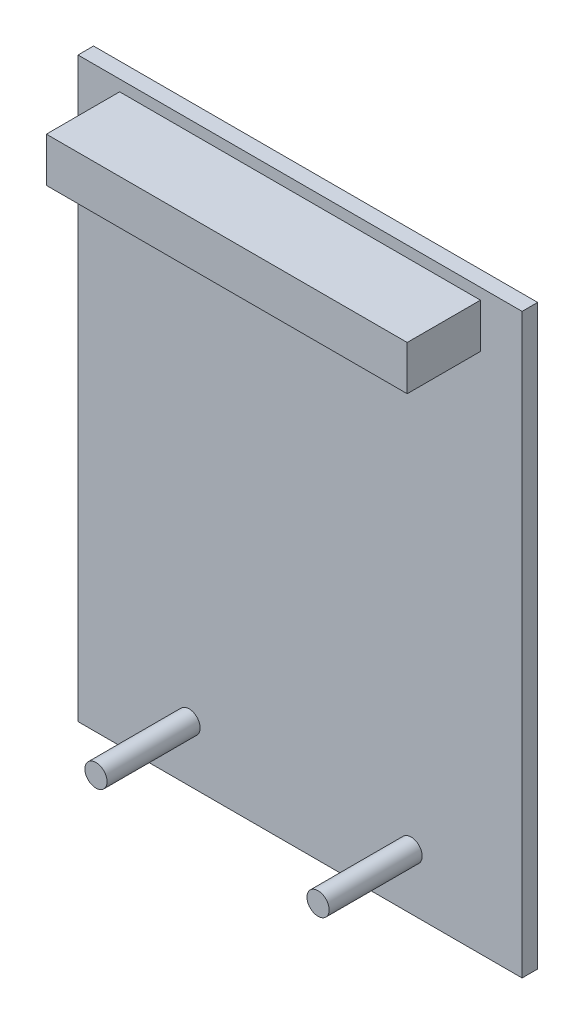
ISO-10303-21;
HEADER;
FILE_DESCRIPTION(('STEP AP214'),'2;1');
FILE_NAME('part.step','',(''),(''),'','','');
FILE_SCHEMA(('AUTOMOTIVE_DESIGN { 1 0 10303 214 1 1 1 1 }'));
ENDSEC;
DATA;
#1=APPLICATION_CONTEXT('core data for automotive mechanical design processes');
#2=APPLICATION_PROTOCOL_DEFINITION('international standard','automotive_design',2000,#1);
#3=PRODUCT_CONTEXT('',#1,'mechanical');
#4=PRODUCT('Part','Part','',(#3));
#5=PRODUCT_RELATED_PRODUCT_CATEGORY('part','',(#4));
#6=PRODUCT_DEFINITION_FORMATION('','',#4);
#7=PRODUCT_DEFINITION_CONTEXT('part definition',#1,'design');
#8=PRODUCT_DEFINITION('design','',#6,#7);
#9=PRODUCT_DEFINITION_SHAPE('','',#8);
#10=(LENGTH_UNIT() NAMED_UNIT(*) SI_UNIT(.MILLI.,.METRE.));
#11=(NAMED_UNIT(*) PLANE_ANGLE_UNIT() SI_UNIT($,.RADIAN.));
#12=(NAMED_UNIT(*) SI_UNIT($,.STERADIAN.) SOLID_ANGLE_UNIT());
#13=UNCERTAINTY_MEASURE_WITH_UNIT(LENGTH_MEASURE(1.E-05),#10,'distance_accuracy_value','');
#14=(GEOMETRIC_REPRESENTATION_CONTEXT(3) GLOBAL_UNCERTAINTY_ASSIGNED_CONTEXT((#13)) GLOBAL_UNIT_ASSIGNED_CONTEXT((#10,
#11,#12)) REPRESENTATION_CONTEXT('',''));
#15=CARTESIAN_POINT('',(0.,0.,0.));
#16=DIRECTION('',(0.,0.,1.));
#17=DIRECTION('',(1.,0.,0.));
#18=AXIS2_PLACEMENT_3D('',#15,#16,#17);
#19=CARTESIAN_POINT('',(0.,0.,1.778));
#20=DIRECTION('',(0.,0.,1.));
#21=DIRECTION('',(1.,0.,0.));
#22=AXIS2_PLACEMENT_3D('',#19,#20,#21);
#23=PLANE('',#22);
#24=CARTESIAN_POINT('',(38.1,6.35000000000001,1.778));
#25=DIRECTION('',(0.,0.,1.));
#26=DIRECTION('',(1.,0.,0.));
#27=AXIS2_PLACEMENT_3D('',#24,#25,#26);
#28=CIRCLE('',#27,1.27);
#29=CARTESIAN_POINT('',(39.37,6.35000000000001,1.778));
#30=VERTEX_POINT('',#29);
#31=EDGE_CURVE('E220',#30,#30,#28,.T.);
#32=ORIENTED_EDGE('',*,*,#31,.F.);
#33=EDGE_LOOP('',(#32));
#34=FACE_BOUND('',#33,.T.);
#35=CARTESIAN_POINT('',(12.7,6.35000000000001,1.778));
#36=DIRECTION('',(0.,0.,1.));
#37=DIRECTION('',(1.,0.,0.));
#38=AXIS2_PLACEMENT_3D('',#35,#36,#37);
#39=CIRCLE('',#38,1.27);
#40=CARTESIAN_POINT('',(13.97,6.35000000000001,1.778));
#41=VERTEX_POINT('',#40);
#42=EDGE_CURVE('E219',#41,#41,#39,.T.);
#43=ORIENTED_EDGE('',*,*,#42,.F.);
#44=EDGE_LOOP('',(#43));
#45=FACE_BOUND('',#44,.T.);
#46=DIRECTION('',(0.,-1.,0.));
#47=VECTOR('',#46,1.);
#48=CARTESIAN_POINT('',(0.,66.04,1.778));
#49=LINE('',#48,#47);
#50=CARTESIAN_POINT('',(0.,66.04,1.778));
#51=VERTEX_POINT('',#50);
#52=CARTESIAN_POINT('',(0.,0.,1.778));
#53=VERTEX_POINT('',#52);
#54=EDGE_CURVE('E140',#51,#53,#49,.T.);
#55=ORIENTED_EDGE('',*,*,#54,.T.);
#56=DIRECTION('',(1.,0.,0.));
#57=VECTOR('',#56,1.);
#58=CARTESIAN_POINT('',(0.,0.,1.778));
#59=LINE('',#58,#57);
#60=CARTESIAN_POINT('',(50.8,0.,1.778));
#61=VERTEX_POINT('',#60);
#62=EDGE_CURVE('E85',#53,#61,#59,.T.);
#63=ORIENTED_EDGE('',*,*,#62,.T.);
#64=DIRECTION('',(0.,1.,0.));
#65=VECTOR('',#64,1.);
#66=CARTESIAN_POINT('',(50.8,66.04,1.778));
#67=LINE('',#66,#65);
#68=CARTESIAN_POINT('',(50.8,66.04,1.778));
#69=VERTEX_POINT('',#68);
#70=EDGE_CURVE('E143',#61,#69,#67,.T.);
#71=ORIENTED_EDGE('',*,*,#70,.T.);
#72=DIRECTION('',(-1.,0.,0.));
#73=VECTOR('',#72,1.);
#74=CARTESIAN_POINT('',(0.,66.04,1.778));
#75=LINE('',#74,#73);
#76=EDGE_CURVE('E57',#69,#51,#75,.T.);
#77=ORIENTED_EDGE('',*,*,#76,.T.);
#78=EDGE_LOOP('',(#55,#63,#71,#77));
#79=FACE_BOUND('',#78,.T.);
#80=DIRECTION('',(1.,0.,0.));
#81=VECTOR('',#80,1.);
#82=CARTESIAN_POINT('',(4.76250000000001,59.69,1.778));
#83=LINE('',#82,#81);
#84=CARTESIAN_POINT('',(4.76250000000001,59.69,1.778));
#85=VERTEX_POINT('',#84);
#86=CARTESIAN_POINT('',(46.0375,59.69,1.778));
#87=VERTEX_POINT('',#86);
#88=EDGE_CURVE('E234',#85,#87,#83,.T.);
#89=ORIENTED_EDGE('',*,*,#88,.F.);
#90=DIRECTION('',(0.,-1.,0.));
#91=VECTOR('',#90,1.);
#92=CARTESIAN_POINT('',(4.76250000000001,64.77,1.778));
#93=LINE('',#92,#91);
#94=CARTESIAN_POINT('',(4.76250000000001,64.77,1.778));
#95=VERTEX_POINT('',#94);
#96=EDGE_CURVE('E130',#95,#85,#93,.T.);
#97=ORIENTED_EDGE('',*,*,#96,.F.);
#98=DIRECTION('',(-1.,0.,0.));
#99=VECTOR('',#98,1.);
#100=CARTESIAN_POINT('',(4.76250000000001,64.77,1.778));
#101=LINE('',#100,#99);
#102=CARTESIAN_POINT('',(46.0375,64.77,1.778));
#103=VERTEX_POINT('',#102);
#104=EDGE_CURVE('E126',#103,#95,#101,.T.);
#105=ORIENTED_EDGE('',*,*,#104,.F.);
#106=DIRECTION('',(0.,1.,0.));
#107=VECTOR('',#106,1.);
#108=CARTESIAN_POINT('',(46.0375,64.77,1.778));
#109=LINE('',#108,#107);
#110=EDGE_CURVE('E236',#87,#103,#109,.T.);
#111=ORIENTED_EDGE('',*,*,#110,.F.);
#112=EDGE_LOOP('',(#89,#97,#105,#111));
#113=FACE_BOUND('',#112,.T.);
#114=ADVANCED_FACE('F33',(#34,#45,#79,#113),#23,.T.);
#115=CARTESIAN_POINT('',(0.,66.04,1.778));
#116=DIRECTION('',(1.,0.,0.));
#117=DIRECTION('',(0.,1.,0.));
#118=AXIS2_PLACEMENT_3D('',#115,#116,#117);
#119=PLANE('',#118);
#120=DIRECTION('',(0.,-1.,0.));
#121=VECTOR('',#120,1.);
#122=CARTESIAN_POINT('',(0.,66.04,0.));
#123=LINE('',#122,#121);
#124=CARTESIAN_POINT('',(0.,66.04,0.));
#125=VERTEX_POINT('',#124);
#126=CARTESIAN_POINT('',(0.,0.,0.));
#127=VERTEX_POINT('',#126);
#128=EDGE_CURVE('E132',#125,#127,#123,.T.);
#129=ORIENTED_EDGE('',*,*,#128,.T.);
#130=DIRECTION('',(0.,0.,-1.));
#131=VECTOR('',#130,1.);
#132=CARTESIAN_POINT('',(0.,0.,1.778));
#133=LINE('',#132,#131);
#134=EDGE_CURVE('E11',#53,#127,#133,.T.);
#135=ORIENTED_EDGE('',*,*,#134,.F.);
#136=ORIENTED_EDGE('',*,*,#54,.F.);
#137=DIRECTION('',(0.,0.,-1.));
#138=VECTOR('',#137,1.);
#139=CARTESIAN_POINT('',(0.,66.04,1.778));
#140=LINE('',#139,#138);
#141=EDGE_CURVE('E145',#51,#125,#140,.T.);
#142=ORIENTED_EDGE('',*,*,#141,.T.);
#143=EDGE_LOOP('',(#129,#135,#136,#142));
#144=FACE_BOUND('',#143,.T.);
#145=ADVANCED_FACE('F35',(#144),#119,.F.);
#146=CARTESIAN_POINT('',(0.,0.,1.778));
#147=DIRECTION('',(0.,1.,0.));
#148=DIRECTION('',(-1.,0.,0.));
#149=AXIS2_PLACEMENT_3D('',#146,#147,#148);
#150=PLANE('',#149);
#151=DIRECTION('',(1.,0.,0.));
#152=VECTOR('',#151,1.);
#153=CARTESIAN_POINT('',(0.,0.,0.));
#154=LINE('',#153,#152);
#155=CARTESIAN_POINT('',(50.8,0.,0.));
#156=VERTEX_POINT('',#155);
#157=EDGE_CURVE('E135',#127,#156,#154,.T.);
#158=ORIENTED_EDGE('',*,*,#157,.T.);
#159=DIRECTION('',(0.,0.,-1.));
#160=VECTOR('',#159,1.);
#161=CARTESIAN_POINT('',(50.8,0.,1.778));
#162=LINE('',#161,#160);
#163=EDGE_CURVE('E41',#61,#156,#162,.T.);
#164=ORIENTED_EDGE('',*,*,#163,.F.);
#165=ORIENTED_EDGE('',*,*,#62,.F.);
#166=ORIENTED_EDGE('',*,*,#134,.T.);
#167=EDGE_LOOP('',(#158,#164,#165,#166));
#168=FACE_BOUND('',#167,.T.);
#169=ADVANCED_FACE('F173',(#168),#150,.F.);
#170=CARTESIAN_POINT('',(50.8,66.04,1.778));
#171=DIRECTION('',(-1.,0.,0.));
#172=DIRECTION('',(0.,0.,1.));
#173=AXIS2_PLACEMENT_3D('',#170,#171,#172);
#174=PLANE('',#173);
#175=DIRECTION('',(0.,1.,0.));
#176=VECTOR('',#175,1.);
#177=CARTESIAN_POINT('',(50.8,66.04,0.));
#178=LINE('',#177,#176);
#179=CARTESIAN_POINT('',(50.8,66.04,0.));
#180=VERTEX_POINT('',#179);
#181=EDGE_CURVE('E148',#156,#180,#178,.T.);
#182=ORIENTED_EDGE('',*,*,#181,.T.);
#183=DIRECTION('',(0.,0.,-1.));
#184=VECTOR('',#183,1.);
#185=CARTESIAN_POINT('',(50.8,66.04,1.778));
#186=LINE('',#185,#184);
#187=EDGE_CURVE('E152',#69,#180,#186,.T.);
#188=ORIENTED_EDGE('',*,*,#187,.F.);
#189=ORIENTED_EDGE('',*,*,#70,.F.);
#190=ORIENTED_EDGE('',*,*,#163,.T.);
#191=EDGE_LOOP('',(#182,#188,#189,#190));
#192=FACE_BOUND('',#191,.T.);
#193=ADVANCED_FACE('F157',(#192),#174,.F.);
#194=CARTESIAN_POINT('',(0.,66.04,1.778));
#195=DIRECTION('',(0.,-1.,0.));
#196=DIRECTION('',(1.,0.,0.));
#197=AXIS2_PLACEMENT_3D('',#194,#195,#196);
#198=PLANE('',#197);
#199=DIRECTION('',(-1.,0.,0.));
#200=VECTOR('',#199,1.);
#201=CARTESIAN_POINT('',(0.,66.04,0.));
#202=LINE('',#201,#200);
#203=EDGE_CURVE('E78',#180,#125,#202,.T.);
#204=ORIENTED_EDGE('',*,*,#203,.T.);
#205=ORIENTED_EDGE('',*,*,#141,.F.);
#206=ORIENTED_EDGE('',*,*,#76,.F.);
#207=ORIENTED_EDGE('',*,*,#187,.T.);
#208=EDGE_LOOP('',(#204,#205,#206,#207));
#209=FACE_BOUND('',#208,.T.);
#210=ADVANCED_FACE('F165',(#209),#198,.F.);
#211=CARTESIAN_POINT('',(0.,0.,0.));
#212=DIRECTION('',(0.,0.,1.));
#213=DIRECTION('',(1.,0.,0.));
#214=AXIS2_PLACEMENT_3D('',#211,#212,#213);
#215=PLANE('',#214);
#216=ORIENTED_EDGE('',*,*,#128,.F.);
#217=ORIENTED_EDGE('',*,*,#203,.F.);
#218=ORIENTED_EDGE('',*,*,#181,.F.);
#219=ORIENTED_EDGE('',*,*,#157,.F.);
#220=EDGE_LOOP('',(#216,#217,#218,#219));
#221=FACE_BOUND('',#220,.T.);
#222=ADVANCED_FACE('F161',(#221),#215,.F.);
#223=CARTESIAN_POINT('',(4.76250000000001,64.77,10.16));
#224=DIRECTION('',(1.,0.,0.));
#225=DIRECTION('',(0.,0.,-1.));
#226=AXIS2_PLACEMENT_3D('',#223,#224,#225);
#227=PLANE('',#226);
#228=ORIENTED_EDGE('',*,*,#96,.T.);
#229=DIRECTION('',(0.,0.,-1.));
#230=VECTOR('',#229,1.);
#231=CARTESIAN_POINT('',(4.76250000000001,59.69,10.16));
#232=LINE('',#231,#230);
#233=CARTESIAN_POINT('',(4.76250000000001,59.69,10.16));
#234=VERTEX_POINT('',#233);
#235=EDGE_CURVE('E111',#234,#85,#232,.T.);
#236=ORIENTED_EDGE('',*,*,#235,.F.);
#237=DIRECTION('',(0.,-1.,0.));
#238=VECTOR('',#237,1.);
#239=CARTESIAN_POINT('',(4.76250000000001,64.77,10.16));
#240=LINE('',#239,#238);
#241=CARTESIAN_POINT('',(4.76250000000001,64.77,10.16));
#242=VERTEX_POINT('',#241);
#243=EDGE_CURVE('E118',#242,#234,#240,.T.);
#244=ORIENTED_EDGE('',*,*,#243,.F.);
#245=DIRECTION('',(0.,0.,-1.));
#246=VECTOR('',#245,1.);
#247=CARTESIAN_POINT('',(4.76250000000001,64.77,10.16));
#248=LINE('',#247,#246);
#249=EDGE_CURVE('E232',#242,#95,#248,.T.);
#250=ORIENTED_EDGE('',*,*,#249,.T.);
#251=EDGE_LOOP('',(#228,#236,#244,#250));
#252=FACE_BOUND('',#251,.T.);
#253=ADVANCED_FACE('F128',(#252),#227,.F.);
#254=CARTESIAN_POINT('',(4.76250000000001,59.69,10.16));
#255=DIRECTION('',(0.,1.,0.));
#256=DIRECTION('',(0.,0.,1.));
#257=AXIS2_PLACEMENT_3D('',#254,#255,#256);
#258=PLANE('',#257);
#259=ORIENTED_EDGE('',*,*,#88,.T.);
#260=DIRECTION('',(0.,0.,-1.));
#261=VECTOR('',#260,1.);
#262=CARTESIAN_POINT('',(46.0375,59.69,10.16));
#263=LINE('',#262,#261);
#264=CARTESIAN_POINT('',(46.0375,59.69,10.16));
#265=VERTEX_POINT('',#264);
#266=EDGE_CURVE('E114',#265,#87,#263,.T.);
#267=ORIENTED_EDGE('',*,*,#266,.F.);
#268=DIRECTION('',(1.,0.,0.));
#269=VECTOR('',#268,1.);
#270=CARTESIAN_POINT('',(4.76250000000001,59.69,10.16));
#271=LINE('',#270,#269);
#272=EDGE_CURVE('E107',#234,#265,#271,.T.);
#273=ORIENTED_EDGE('',*,*,#272,.F.);
#274=ORIENTED_EDGE('',*,*,#235,.T.);
#275=EDGE_LOOP('',(#259,#267,#273,#274));
#276=FACE_BOUND('',#275,.T.);
#277=ADVANCED_FACE('F109',(#276),#258,.F.);
#278=CARTESIAN_POINT('',(46.0375,64.77,10.16));
#279=DIRECTION('',(-1.,0.,0.));
#280=DIRECTION('',(0.,0.,1.));
#281=AXIS2_PLACEMENT_3D('',#278,#279,#280);
#282=PLANE('',#281);
#283=ORIENTED_EDGE('',*,*,#110,.T.);
#284=DIRECTION('',(0.,0.,-1.));
#285=VECTOR('',#284,1.);
#286=CARTESIAN_POINT('',(46.0375,64.77,10.16));
#287=LINE('',#286,#285);
#288=CARTESIAN_POINT('',(46.0375,64.77,10.16));
#289=VERTEX_POINT('',#288);
#290=EDGE_CURVE('E48',#289,#103,#287,.T.);
#291=ORIENTED_EDGE('',*,*,#290,.F.);
#292=DIRECTION('',(0.,1.,0.));
#293=VECTOR('',#292,1.);
#294=CARTESIAN_POINT('',(46.0375,64.77,10.16));
#295=LINE('',#294,#293);
#296=EDGE_CURVE('E117',#265,#289,#295,.T.);
#297=ORIENTED_EDGE('',*,*,#296,.F.);
#298=ORIENTED_EDGE('',*,*,#266,.T.);
#299=EDGE_LOOP('',(#283,#291,#297,#298));
#300=FACE_BOUND('',#299,.T.);
#301=ADVANCED_FACE('F190',(#300),#282,.F.);
#302=CARTESIAN_POINT('',(4.76250000000001,64.77,10.16));
#303=DIRECTION('',(0.,-1.,0.));
#304=DIRECTION('',(1.,0.,0.));
#305=AXIS2_PLACEMENT_3D('',#302,#303,#304);
#306=PLANE('',#305);
#307=ORIENTED_EDGE('',*,*,#104,.T.);
#308=ORIENTED_EDGE('',*,*,#249,.F.);
#309=DIRECTION('',(-1.,0.,0.));
#310=VECTOR('',#309,1.);
#311=CARTESIAN_POINT('',(4.76250000000001,64.77,10.16));
#312=LINE('',#311,#310);
#313=EDGE_CURVE('E122',#289,#242,#312,.T.);
#314=ORIENTED_EDGE('',*,*,#313,.F.);
#315=ORIENTED_EDGE('',*,*,#290,.T.);
#316=EDGE_LOOP('',(#307,#308,#314,#315));
#317=FACE_BOUND('',#316,.T.);
#318=ADVANCED_FACE('F193',(#317),#306,.F.);
#319=CARTESIAN_POINT('',(0.,0.,10.16));
#320=DIRECTION('',(0.,0.,1.));
#321=DIRECTION('',(1.,0.,0.));
#322=AXIS2_PLACEMENT_3D('',#319,#320,#321);
#323=PLANE('',#322);
#324=ORIENTED_EDGE('',*,*,#243,.T.);
#325=ORIENTED_EDGE('',*,*,#272,.T.);
#326=ORIENTED_EDGE('',*,*,#296,.T.);
#327=ORIENTED_EDGE('',*,*,#313,.T.);
#328=EDGE_LOOP('',(#324,#325,#326,#327));
#329=FACE_BOUND('',#328,.T.);
#330=ADVANCED_FACE('F121',(#329),#323,.T.);
#331=CARTESIAN_POINT('',(12.7,6.35000000000001,12.4206));
#332=DIRECTION('',(0.,0.,-1.));
#333=DIRECTION('',(-1.,0.,0.));
#334=AXIS2_PLACEMENT_3D('',#331,#332,#333);
#335=CYLINDRICAL_SURFACE('',#334,1.27);
#336=CARTESIAN_POINT('',(12.7,6.35000000000001,12.4206));
#337=DIRECTION('',(0.,0.,1.));
#338=DIRECTION('',(1.,0.,0.));
#339=AXIS2_PLACEMENT_3D('',#336,#337,#338);
#340=CIRCLE('',#339,1.27);
#341=CARTESIAN_POINT('',(13.97,6.35000000000001,12.4206));
#342=VERTEX_POINT('',#341);
#343=EDGE_CURVE('E223',#342,#342,#340,.T.);
#344=ORIENTED_EDGE('',*,*,#343,.F.);
#345=EDGE_LOOP('',(#344));
#346=FACE_BOUND('',#345,.T.);
#347=ORIENTED_EDGE('',*,*,#42,.T.);
#348=EDGE_LOOP('',(#347));
#349=FACE_BOUND('',#348,.T.);
#350=ADVANCED_FACE('F199',(#346,#349),#335,.T.);
#351=CARTESIAN_POINT('',(12.7,6.35000000000001,12.4206));
#352=DIRECTION('',(0.,0.,1.));
#353=DIRECTION('',(1.,0.,0.));
#354=AXIS2_PLACEMENT_3D('',#351,#352,#353);
#355=PLANE('',#354);
#356=ORIENTED_EDGE('',*,*,#343,.T.);
#357=EDGE_LOOP('',(#356));
#358=FACE_BOUND('',#357,.T.);
#359=ADVANCED_FACE('F202',(#358),#355,.T.);
#360=CARTESIAN_POINT('',(38.1,6.35000000000001,12.4206));
#361=DIRECTION('',(0.,0.,-1.));
#362=DIRECTION('',(-1.,0.,0.));
#363=AXIS2_PLACEMENT_3D('',#360,#361,#362);
#364=CYLINDRICAL_SURFACE('',#363,1.27);
#365=CARTESIAN_POINT('',(38.1,6.35000000000001,12.4206));
#366=DIRECTION('',(0.,0.,1.));
#367=DIRECTION('',(1.,0.,0.));
#368=AXIS2_PLACEMENT_3D('',#365,#366,#367);
#369=CIRCLE('',#368,1.27);
#370=CARTESIAN_POINT('',(39.37,6.35000000000001,12.4206));
#371=VERTEX_POINT('',#370);
#372=EDGE_CURVE('E218',#371,#371,#369,.T.);
#373=ORIENTED_EDGE('',*,*,#372,.F.);
#374=EDGE_LOOP('',(#373));
#375=FACE_BOUND('',#374,.T.);
#376=ORIENTED_EDGE('',*,*,#31,.T.);
#377=EDGE_LOOP('',(#376));
#378=FACE_BOUND('',#377,.T.);
#379=ADVANCED_FACE('F206',(#375,#378),#364,.T.);
#380=CARTESIAN_POINT('',(38.1,6.35000000000001,12.4206));
#381=DIRECTION('',(0.,0.,1.));
#382=DIRECTION('',(1.,0.,0.));
#383=AXIS2_PLACEMENT_3D('',#380,#381,#382);
#384=PLANE('',#383);
#385=ORIENTED_EDGE('',*,*,#372,.T.);
#386=EDGE_LOOP('',(#385));
#387=FACE_BOUND('',#386,.T.);
#388=ADVANCED_FACE('F210',(#387),#384,.T.);
#389=CLOSED_SHELL('',(#114,#145,#169,#193,#210,#222,#253,#277,#301,#318,#330,#350,#359,#379,#388));
#390=MANIFOLD_SOLID_BREP('B2',#389);
#391=ADVANCED_BREP_SHAPE_REPRESENTATION('',(#18,#390),#14);
#392=SHAPE_DEFINITION_REPRESENTATION(#9,#391);
ENDSEC;
END-ISO-10303-21;
